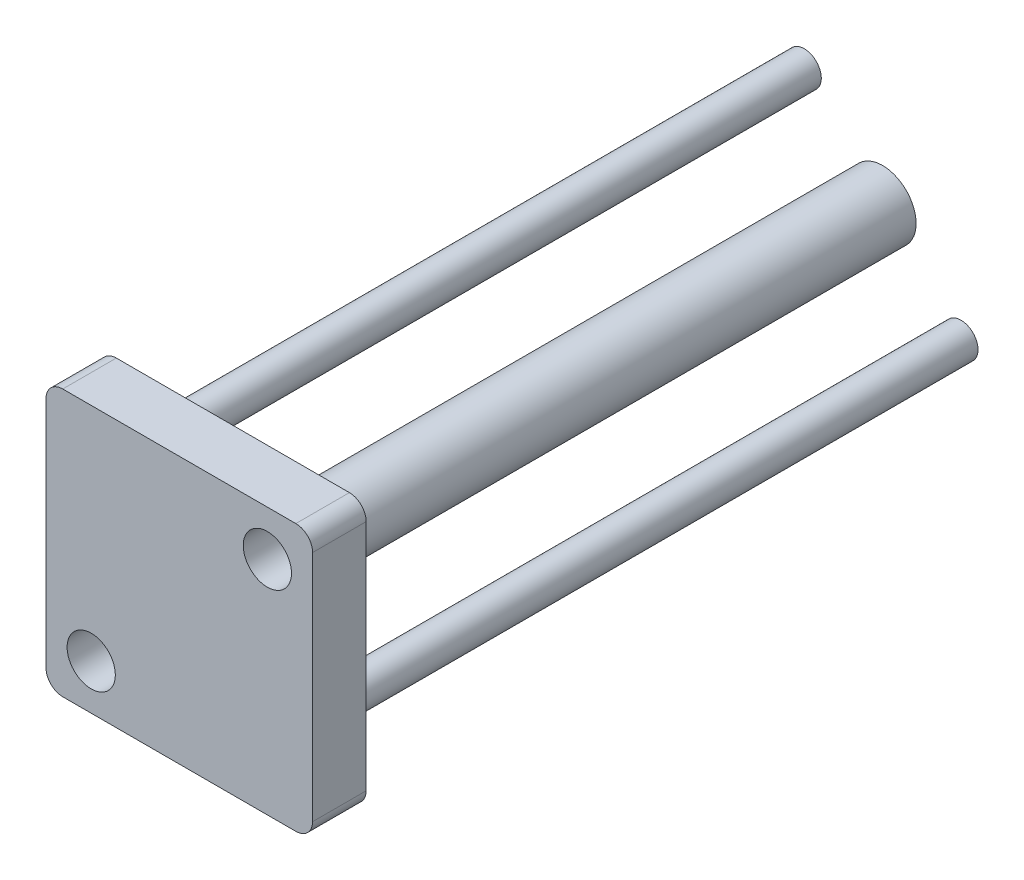
ISO-10303-21;
HEADER;
FILE_DESCRIPTION(('STEP AP214'),'2;1');
FILE_NAME('part.step','',(''),(''),'','','');
FILE_SCHEMA(('AUTOMOTIVE_DESIGN { 1 0 10303 214 1 1 1 1 }'));
ENDSEC;
DATA;
#1=APPLICATION_CONTEXT('core data for automotive mechanical design processes');
#2=APPLICATION_PROTOCOL_DEFINITION('international standard','automotive_design',2000,#1);
#3=PRODUCT_CONTEXT('',#1,'mechanical');
#4=PRODUCT('Part','Part','',(#3));
#5=PRODUCT_RELATED_PRODUCT_CATEGORY('part','',(#4));
#6=PRODUCT_DEFINITION_FORMATION('','',#4);
#7=PRODUCT_DEFINITION_CONTEXT('part definition',#1,'design');
#8=PRODUCT_DEFINITION('design','',#6,#7);
#9=PRODUCT_DEFINITION_SHAPE('','',#8);
#10=(LENGTH_UNIT() NAMED_UNIT(*) SI_UNIT(.MILLI.,.METRE.));
#11=(NAMED_UNIT(*) PLANE_ANGLE_UNIT() SI_UNIT($,.RADIAN.));
#12=(NAMED_UNIT(*) SI_UNIT($,.STERADIAN.) SOLID_ANGLE_UNIT());
#13=UNCERTAINTY_MEASURE_WITH_UNIT(LENGTH_MEASURE(1.E-05),#10,'distance_accuracy_value','');
#14=(GEOMETRIC_REPRESENTATION_CONTEXT(3) GLOBAL_UNCERTAINTY_ASSIGNED_CONTEXT((#13)) GLOBAL_UNIT_ASSIGNED_CONTEXT((#10,
#11,#12)) REPRESENTATION_CONTEXT('',''));
#15=CARTESIAN_POINT('',(0.,0.,0.));
#16=DIRECTION('',(0.,0.,1.));
#17=DIRECTION('',(1.,0.,0.));
#18=AXIS2_PLACEMENT_3D('',#15,#16,#17);
#19=CARTESIAN_POINT('',(0.,0.,97.));
#20=DIRECTION('',(0.,0.,-1.));
#21=DIRECTION('',(-1.,0.,0.));
#22=AXIS2_PLACEMENT_3D('',#19,#20,#21);
#23=CYLINDRICAL_SURFACE('',#22,5.);
#24=CARTESIAN_POINT('',(0.,0.,97.));
#25=DIRECTION('',(0.,0.,1.));
#26=DIRECTION('',(1.,0.,0.));
#27=AXIS2_PLACEMENT_3D('',#24,#25,#26);
#28=CIRCLE('',#27,5.);
#29=CARTESIAN_POINT('',(5.,0.,97.));
#30=VERTEX_POINT('',#29);
#31=EDGE_CURVE('E194',#30,#30,#28,.T.);
#32=ORIENTED_EDGE('',*,*,#31,.F.);
#33=EDGE_LOOP('',(#32));
#34=FACE_BOUND('',#33,.T.);
#35=CARTESIAN_POINT('',(0.,0.,0.));
#36=DIRECTION('',(0.,0.,1.));
#37=DIRECTION('',(1.,0.,0.));
#38=AXIS2_PLACEMENT_3D('',#35,#36,#37);
#39=CIRCLE('',#38,5.);
#40=CARTESIAN_POINT('',(5.,0.,0.));
#41=VERTEX_POINT('',#40);
#42=EDGE_CURVE('E193',#41,#41,#39,.T.);
#43=ORIENTED_EDGE('',*,*,#42,.T.);
#44=EDGE_LOOP('',(#43));
#45=FACE_BOUND('',#44,.T.);
#46=ADVANCED_FACE('F45',(#34,#45),#23,.T.);
#47=CARTESIAN_POINT('',(0.,0.,0.));
#48=DIRECTION('',(0.,0.,1.));
#49=DIRECTION('',(1.,0.,0.));
#50=AXIS2_PLACEMENT_3D('',#47,#48,#49);
#51=PLANE('',#50);
#52=ORIENTED_EDGE('',*,*,#42,.F.);
#53=EDGE_LOOP('',(#52));
#54=FACE_BOUND('',#53,.T.);
#55=ADVANCED_FACE('F283',(#54),#51,.F.);
#56=CARTESIAN_POINT('',(-17.4,-17.4,105.));
#57=DIRECTION('',(0.,0.,-1.));
#58=DIRECTION('',(-1.,0.,0.));
#59=AXIS2_PLACEMENT_3D('',#56,#57,#58);
#60=PLANE('',#59);
#61=CARTESIAN_POINT('',(-17.4,-17.4,105.));
#62=DIRECTION('',(0.,0.,1.));
#63=DIRECTION('',(-1.,0.,0.));
#64=AXIS2_PLACEMENT_3D('',#61,#62,#63);
#65=CIRCLE('',#64,2.5);
#66=CARTESIAN_POINT('',(-19.9,-17.4,105.));
#67=VERTEX_POINT('',#66);
#68=CARTESIAN_POINT('',(-17.4,-19.9,105.));
#69=VERTEX_POINT('',#68);
#70=EDGE_CURVE('E171',#67,#69,#65,.T.);
#71=ORIENTED_EDGE('',*,*,#70,.T.);
#72=DIRECTION('',(1.,0.,0.));
#73=VECTOR('',#72,1.);
#74=CARTESIAN_POINT('',(-17.4,-19.9,105.));
#75=LINE('',#74,#73);
#76=CARTESIAN_POINT('',(17.4,-19.9,105.));
#77=VERTEX_POINT('',#76);
#78=EDGE_CURVE('E106',#69,#77,#75,.T.);
#79=ORIENTED_EDGE('',*,*,#78,.T.);
#80=CARTESIAN_POINT('',(17.4,-17.4,105.));
#81=DIRECTION('',(0.,0.,1.));
#82=DIRECTION('',(1.,0.,0.));
#83=AXIS2_PLACEMENT_3D('',#80,#81,#82);
#84=CIRCLE('',#83,2.5);
#85=CARTESIAN_POINT('',(19.9,-17.4,105.));
#86=VERTEX_POINT('',#85);
#87=EDGE_CURVE('E247',#77,#86,#84,.T.);
#88=ORIENTED_EDGE('',*,*,#87,.T.);
#89=DIRECTION('',(0.,1.,0.));
#90=VECTOR('',#89,1.);
#91=CARTESIAN_POINT('',(19.9,-17.4,105.));
#92=LINE('',#91,#90);
#93=CARTESIAN_POINT('',(19.9,17.4,105.));
#94=VERTEX_POINT('',#93);
#95=EDGE_CURVE('E250',#86,#94,#92,.T.);
#96=ORIENTED_EDGE('',*,*,#95,.T.);
#97=CARTESIAN_POINT('',(17.4,17.4,105.));
#98=DIRECTION('',(0.,0.,1.));
#99=DIRECTION('',(-1.,0.,0.));
#100=AXIS2_PLACEMENT_3D('',#97,#98,#99);
#101=CIRCLE('',#100,2.50000000000001);
#102=CARTESIAN_POINT('',(17.4,19.9,105.));
#103=VERTEX_POINT('',#102);
#104=EDGE_CURVE('E126',#94,#103,#101,.T.);
#105=ORIENTED_EDGE('',*,*,#104,.T.);
#106=DIRECTION('',(-1.,0.,0.));
#107=VECTOR('',#106,1.);
#108=CARTESIAN_POINT('',(-17.4,19.9,105.));
#109=LINE('',#108,#107);
#110=CARTESIAN_POINT('',(-17.4,19.9,105.));
#111=VERTEX_POINT('',#110);
#112=EDGE_CURVE('E119',#103,#111,#109,.T.);
#113=ORIENTED_EDGE('',*,*,#112,.T.);
#114=CARTESIAN_POINT('',(-17.4,17.4,105.));
#115=DIRECTION('',(0.,0.,1.));
#116=DIRECTION('',(-1.,0.,0.));
#117=AXIS2_PLACEMENT_3D('',#114,#115,#116);
#118=CIRCLE('',#117,2.5);
#119=CARTESIAN_POINT('',(-19.9,17.4,105.));
#120=VERTEX_POINT('',#119);
#121=EDGE_CURVE('E124',#111,#120,#118,.T.);
#122=ORIENTED_EDGE('',*,*,#121,.T.);
#123=DIRECTION('',(0.,-1.,0.));
#124=VECTOR('',#123,1.);
#125=CARTESIAN_POINT('',(-19.9,-17.4,105.));
#126=LINE('',#125,#124);
#127=EDGE_CURVE('E62',#120,#67,#126,.T.);
#128=ORIENTED_EDGE('',*,*,#127,.T.);
#129=EDGE_LOOP('',(#71,#79,#88,#96,#105,#113,#122,#128));
#130=FACE_BOUND('',#129,.T.);
#131=CARTESIAN_POINT('',(13.15,13.15,105.));
#132=DIRECTION('',(0.,0.,1.));
#133=DIRECTION('',(1.,0.,0.));
#134=AXIS2_PLACEMENT_3D('',#131,#132,#133);
#135=CIRCLE('',#134,3.6);
#136=CARTESIAN_POINT('',(16.75,13.15,105.));
#137=VERTEX_POINT('',#136);
#138=EDGE_CURVE('E153',#137,#137,#135,.T.);
#139=ORIENTED_EDGE('',*,*,#138,.F.);
#140=EDGE_LOOP('',(#139));
#141=FACE_BOUND('',#140,.T.);
#142=CARTESIAN_POINT('',(-13.15,-13.15,105.));
#143=DIRECTION('',(0.,0.,1.));
#144=DIRECTION('',(1.,0.,0.));
#145=AXIS2_PLACEMENT_3D('',#142,#143,#144);
#146=CIRCLE('',#145,3.6);
#147=CARTESIAN_POINT('',(-9.55000000000001,-13.15,105.));
#148=VERTEX_POINT('',#147);
#149=EDGE_CURVE('E226',#148,#148,#146,.T.);
#150=ORIENTED_EDGE('',*,*,#149,.F.);
#151=EDGE_LOOP('',(#150));
#152=FACE_BOUND('',#151,.T.);
#153=ADVANCED_FACE('F121',(#130,#141,#152),#60,.F.);
#154=CARTESIAN_POINT('',(-17.4,-17.4,97.));
#155=DIRECTION('',(0.,0.,-1.));
#156=DIRECTION('',(-1.,0.,0.));
#157=AXIS2_PLACEMENT_3D('',#154,#155,#156);
#158=PLANE('',#157);
#159=CARTESIAN_POINT('',(11.7,-11.7,97.));
#160=DIRECTION('',(0.,0.,-1.));
#161=DIRECTION('',(-1.,0.,0.));
#162=AXIS2_PLACEMENT_3D('',#159,#160,#161);
#163=CIRCLE('',#162,2.55);
#164=CARTESIAN_POINT('',(9.15,-11.7,97.));
#165=VERTEX_POINT('',#164);
#166=EDGE_CURVE('E11',#165,#165,#163,.T.);
#167=ORIENTED_EDGE('',*,*,#166,.F.);
#168=EDGE_LOOP('',(#167));
#169=FACE_BOUND('',#168,.T.);
#170=CARTESIAN_POINT('',(-11.7,11.7,97.));
#171=DIRECTION('',(0.,0.,-1.));
#172=DIRECTION('',(-1.,0.,0.));
#173=AXIS2_PLACEMENT_3D('',#170,#171,#172);
#174=CIRCLE('',#173,2.55);
#175=CARTESIAN_POINT('',(-14.25,11.7,97.));
#176=VERTEX_POINT('',#175);
#177=EDGE_CURVE('E54',#176,#176,#174,.T.);
#178=ORIENTED_EDGE('',*,*,#177,.F.);
#179=EDGE_LOOP('',(#178));
#180=FACE_BOUND('',#179,.T.);
#181=ORIENTED_EDGE('',*,*,#31,.T.);
#182=EDGE_LOOP('',(#181));
#183=FACE_BOUND('',#182,.T.);
#184=CARTESIAN_POINT('',(13.15,13.15,97.));
#185=DIRECTION('',(0.,0.,1.));
#186=DIRECTION('',(1.,0.,0.));
#187=AXIS2_PLACEMENT_3D('',#184,#185,#186);
#188=CIRCLE('',#187,3.6);
#189=CARTESIAN_POINT('',(16.75,13.15,97.));
#190=VERTEX_POINT('',#189);
#191=EDGE_CURVE('E218',#190,#190,#188,.T.);
#192=ORIENTED_EDGE('',*,*,#191,.T.);
#193=EDGE_LOOP('',(#192));
#194=FACE_BOUND('',#193,.T.);
#195=CARTESIAN_POINT('',(-17.4,-17.4,97.));
#196=DIRECTION('',(0.,0.,1.));
#197=DIRECTION('',(-1.,0.,0.));
#198=AXIS2_PLACEMENT_3D('',#195,#196,#197);
#199=CIRCLE('',#198,2.5);
#200=CARTESIAN_POINT('',(-19.9,-17.4,97.));
#201=VERTEX_POINT('',#200);
#202=CARTESIAN_POINT('',(-17.4,-19.9,97.));
#203=VERTEX_POINT('',#202);
#204=EDGE_CURVE('E148',#201,#203,#199,.T.);
#205=ORIENTED_EDGE('',*,*,#204,.F.);
#206=DIRECTION('',(0.,-1.,0.));
#207=VECTOR('',#206,1.);
#208=CARTESIAN_POINT('',(-19.9,-17.4,97.));
#209=LINE('',#208,#207);
#210=CARTESIAN_POINT('',(-19.9,17.4,97.));
#211=VERTEX_POINT('',#210);
#212=EDGE_CURVE('E97',#211,#201,#209,.T.);
#213=ORIENTED_EDGE('',*,*,#212,.F.);
#214=CARTESIAN_POINT('',(-17.4,17.4,97.));
#215=DIRECTION('',(0.,0.,1.));
#216=DIRECTION('',(-1.,0.,0.));
#217=AXIS2_PLACEMENT_3D('',#214,#215,#216);
#218=CIRCLE('',#217,2.5);
#219=CARTESIAN_POINT('',(-17.4,19.9,97.));
#220=VERTEX_POINT('',#219);
#221=EDGE_CURVE('E91',#220,#211,#218,.T.);
#222=ORIENTED_EDGE('',*,*,#221,.F.);
#223=DIRECTION('',(-1.,0.,0.));
#224=VECTOR('',#223,1.);
#225=CARTESIAN_POINT('',(-17.4,19.9,97.));
#226=LINE('',#225,#224);
#227=CARTESIAN_POINT('',(17.4,19.9,97.));
#228=VERTEX_POINT('',#227);
#229=EDGE_CURVE('E135',#228,#220,#226,.T.);
#230=ORIENTED_EDGE('',*,*,#229,.F.);
#231=CARTESIAN_POINT('',(17.4,17.4,97.));
#232=DIRECTION('',(0.,0.,1.));
#233=DIRECTION('',(-1.,0.,0.));
#234=AXIS2_PLACEMENT_3D('',#231,#232,#233);
#235=CIRCLE('',#234,2.50000000000001);
#236=CARTESIAN_POINT('',(19.9,17.4,97.));
#237=VERTEX_POINT('',#236);
#238=EDGE_CURVE('E162',#237,#228,#235,.T.);
#239=ORIENTED_EDGE('',*,*,#238,.F.);
#240=DIRECTION('',(0.,1.,0.));
#241=VECTOR('',#240,1.);
#242=CARTESIAN_POINT('',(19.9,-17.4,97.));
#243=LINE('',#242,#241);
#244=CARTESIAN_POINT('',(19.9,-17.4,97.));
#245=VERTEX_POINT('',#244);
#246=EDGE_CURVE('E159',#245,#237,#243,.T.);
#247=ORIENTED_EDGE('',*,*,#246,.F.);
#248=CARTESIAN_POINT('',(17.4,-17.4,97.));
#249=DIRECTION('',(0.,0.,1.));
#250=DIRECTION('',(1.,0.,0.));
#251=AXIS2_PLACEMENT_3D('',#248,#249,#250);
#252=CIRCLE('',#251,2.5);
#253=CARTESIAN_POINT('',(17.4,-19.9,97.));
#254=VERTEX_POINT('',#253);
#255=EDGE_CURVE('E156',#254,#245,#252,.T.);
#256=ORIENTED_EDGE('',*,*,#255,.F.);
#257=DIRECTION('',(1.,0.,0.));
#258=VECTOR('',#257,1.);
#259=CARTESIAN_POINT('',(-17.4,-19.9,97.));
#260=LINE('',#259,#258);
#261=EDGE_CURVE('E152',#203,#254,#260,.T.);
#262=ORIENTED_EDGE('',*,*,#261,.F.);
#263=EDGE_LOOP('',(#205,#213,#222,#230,#239,#247,#256,#262));
#264=FACE_BOUND('',#263,.T.);
#265=CARTESIAN_POINT('',(-13.15,-13.15,97.));
#266=DIRECTION('',(0.,0.,1.));
#267=DIRECTION('',(1.,0.,0.));
#268=AXIS2_PLACEMENT_3D('',#265,#266,#267);
#269=CIRCLE('',#268,3.6);
#270=CARTESIAN_POINT('',(-9.55000000000001,-13.15,97.));
#271=VERTEX_POINT('',#270);
#272=EDGE_CURVE('E223',#271,#271,#269,.T.);
#273=ORIENTED_EDGE('',*,*,#272,.T.);
#274=EDGE_LOOP('',(#273));
#275=FACE_BOUND('',#274,.T.);
#276=ADVANCED_FACE('F207',(#169,#180,#183,#194,#264,#275),#158,.T.);
#277=CARTESIAN_POINT('',(-17.4,-17.4,105.));
#278=DIRECTION('',(0.,0.,-1.));
#279=DIRECTION('',(-1.,0.,0.));
#280=AXIS2_PLACEMENT_3D('',#277,#278,#279);
#281=CYLINDRICAL_SURFACE('',#280,2.5);
#282=ORIENTED_EDGE('',*,*,#204,.T.);
#283=DIRECTION('',(0.,0.,-1.));
#284=VECTOR('',#283,1.);
#285=CARTESIAN_POINT('',(-17.4,-19.9,105.));
#286=LINE('',#285,#284);
#287=EDGE_CURVE('E190',#69,#203,#286,.T.);
#288=ORIENTED_EDGE('',*,*,#287,.F.);
#289=ORIENTED_EDGE('',*,*,#70,.F.);
#290=DIRECTION('',(0.,0.,-1.));
#291=VECTOR('',#290,1.);
#292=CARTESIAN_POINT('',(-19.9,-17.4,105.));
#293=LINE('',#292,#291);
#294=EDGE_CURVE('E144',#67,#201,#293,.T.);
#295=ORIENTED_EDGE('',*,*,#294,.T.);
#296=EDGE_LOOP('',(#282,#288,#289,#295));
#297=FACE_BOUND('',#296,.T.);
#298=ADVANCED_FACE('F210',(#297),#281,.T.);
#299=CARTESIAN_POINT('',(-17.4,-19.9,105.));
#300=DIRECTION('',(0.,1.,0.));
#301=DIRECTION('',(0.,0.,1.));
#302=AXIS2_PLACEMENT_3D('',#299,#300,#301);
#303=PLANE('',#302);
#304=ORIENTED_EDGE('',*,*,#261,.T.);
#305=DIRECTION('',(0.,0.,-1.));
#306=VECTOR('',#305,1.);
#307=CARTESIAN_POINT('',(17.4,-19.9,105.));
#308=LINE('',#307,#306);
#309=EDGE_CURVE('E186',#77,#254,#308,.T.);
#310=ORIENTED_EDGE('',*,*,#309,.F.);
#311=ORIENTED_EDGE('',*,*,#78,.F.);
#312=ORIENTED_EDGE('',*,*,#287,.T.);
#313=EDGE_LOOP('',(#304,#310,#311,#312));
#314=FACE_BOUND('',#313,.T.);
#315=ADVANCED_FACE('F266',(#314),#303,.F.);
#316=CARTESIAN_POINT('',(17.4,-17.4,105.));
#317=DIRECTION('',(0.,0.,-1.));
#318=DIRECTION('',(-1.,0.,0.));
#319=AXIS2_PLACEMENT_3D('',#316,#317,#318);
#320=CYLINDRICAL_SURFACE('',#319,2.5);
#321=ORIENTED_EDGE('',*,*,#255,.T.);
#322=DIRECTION('',(0.,0.,-1.));
#323=VECTOR('',#322,1.);
#324=CARTESIAN_POINT('',(19.9,-17.4,105.));
#325=LINE('',#324,#323);
#326=EDGE_CURVE('E182',#86,#245,#325,.T.);
#327=ORIENTED_EDGE('',*,*,#326,.F.);
#328=ORIENTED_EDGE('',*,*,#87,.F.);
#329=ORIENTED_EDGE('',*,*,#309,.T.);
#330=EDGE_LOOP('',(#321,#327,#328,#329));
#331=FACE_BOUND('',#330,.T.);
#332=ADVANCED_FACE('F265',(#331),#320,.T.);
#333=CARTESIAN_POINT('',(19.9,-17.4,105.));
#334=DIRECTION('',(-1.,0.,0.));
#335=DIRECTION('',(0.,-1.,0.));
#336=AXIS2_PLACEMENT_3D('',#333,#334,#335);
#337=PLANE('',#336);
#338=ORIENTED_EDGE('',*,*,#246,.T.);
#339=DIRECTION('',(0.,0.,-1.));
#340=VECTOR('',#339,1.);
#341=CARTESIAN_POINT('',(19.9,17.4,105.));
#342=LINE('',#341,#340);
#343=EDGE_CURVE('E178',#94,#237,#342,.T.);
#344=ORIENTED_EDGE('',*,*,#343,.F.);
#345=ORIENTED_EDGE('',*,*,#95,.F.);
#346=ORIENTED_EDGE('',*,*,#326,.T.);
#347=EDGE_LOOP('',(#338,#344,#345,#346));
#348=FACE_BOUND('',#347,.T.);
#349=ADVANCED_FACE('F258',(#348),#337,.F.);
#350=CARTESIAN_POINT('',(17.4,17.4,105.));
#351=DIRECTION('',(0.,0.,-1.));
#352=DIRECTION('',(-1.,0.,0.));
#353=AXIS2_PLACEMENT_3D('',#350,#351,#352);
#354=CYLINDRICAL_SURFACE('',#353,2.50000000000001);
#355=ORIENTED_EDGE('',*,*,#238,.T.);
#356=DIRECTION('',(0.,0.,-1.));
#357=VECTOR('',#356,1.);
#358=CARTESIAN_POINT('',(17.4,19.9,105.));
#359=LINE('',#358,#357);
#360=EDGE_CURVE('E137',#103,#228,#359,.T.);
#361=ORIENTED_EDGE('',*,*,#360,.F.);
#362=ORIENTED_EDGE('',*,*,#104,.F.);
#363=ORIENTED_EDGE('',*,*,#343,.T.);
#364=EDGE_LOOP('',(#355,#361,#362,#363));
#365=FACE_BOUND('',#364,.T.);
#366=ADVANCED_FACE('F262',(#365),#354,.T.);
#367=CARTESIAN_POINT('',(-17.4,19.9,105.));
#368=DIRECTION('',(0.,-1.,0.));
#369=DIRECTION('',(0.,0.,-1.));
#370=AXIS2_PLACEMENT_3D('',#367,#368,#369);
#371=PLANE('',#370);
#372=ORIENTED_EDGE('',*,*,#229,.T.);
#373=DIRECTION('',(0.,0.,-1.));
#374=VECTOR('',#373,1.);
#375=CARTESIAN_POINT('',(-17.4,19.9,105.));
#376=LINE('',#375,#374);
#377=EDGE_CURVE('E132',#111,#220,#376,.T.);
#378=ORIENTED_EDGE('',*,*,#377,.F.);
#379=ORIENTED_EDGE('',*,*,#112,.F.);
#380=ORIENTED_EDGE('',*,*,#360,.T.);
#381=EDGE_LOOP('',(#372,#378,#379,#380));
#382=FACE_BOUND('',#381,.T.);
#383=ADVANCED_FACE('F133',(#382),#371,.F.);
#384=CARTESIAN_POINT('',(-17.4,17.4,105.));
#385=DIRECTION('',(0.,0.,-1.));
#386=DIRECTION('',(-1.,0.,0.));
#387=AXIS2_PLACEMENT_3D('',#384,#385,#386);
#388=CYLINDRICAL_SURFACE('',#387,2.5);
#389=ORIENTED_EDGE('',*,*,#221,.T.);
#390=DIRECTION('',(0.,0.,-1.));
#391=VECTOR('',#390,1.);
#392=CARTESIAN_POINT('',(-19.9,17.4,105.));
#393=LINE('',#392,#391);
#394=EDGE_CURVE('E138',#120,#211,#393,.T.);
#395=ORIENTED_EDGE('',*,*,#394,.F.);
#396=ORIENTED_EDGE('',*,*,#121,.F.);
#397=ORIENTED_EDGE('',*,*,#377,.T.);
#398=EDGE_LOOP('',(#389,#395,#396,#397));
#399=FACE_BOUND('',#398,.T.);
#400=ADVANCED_FACE('F140',(#399),#388,.T.);
#401=CARTESIAN_POINT('',(-19.9,-17.4,105.));
#402=DIRECTION('',(1.,0.,0.));
#403=DIRECTION('',(0.,1.,0.));
#404=AXIS2_PLACEMENT_3D('',#401,#402,#403);
#405=PLANE('',#404);
#406=ORIENTED_EDGE('',*,*,#212,.T.);
#407=ORIENTED_EDGE('',*,*,#294,.F.);
#408=ORIENTED_EDGE('',*,*,#127,.F.);
#409=ORIENTED_EDGE('',*,*,#394,.T.);
#410=EDGE_LOOP('',(#406,#407,#408,#409));
#411=FACE_BOUND('',#410,.T.);
#412=ADVANCED_FACE('F270',(#411),#405,.F.);
#413=CARTESIAN_POINT('',(13.15,13.15,105.));
#414=DIRECTION('',(0.,0.,-1.));
#415=DIRECTION('',(-1.,0.,0.));
#416=AXIS2_PLACEMENT_3D('',#413,#414,#415);
#417=CYLINDRICAL_SURFACE('',#416,3.6);
#418=ORIENTED_EDGE('',*,*,#138,.T.);
#419=EDGE_LOOP('',(#418));
#420=FACE_BOUND('',#419,.T.);
#421=ORIENTED_EDGE('',*,*,#191,.F.);
#422=EDGE_LOOP('',(#421));
#423=FACE_BOUND('',#422,.T.);
#424=ADVANCED_FACE('F272',(#420,#423),#417,.F.);
#425=CARTESIAN_POINT('',(-13.15,-13.15,105.));
#426=DIRECTION('',(0.,0.,-1.));
#427=DIRECTION('',(-1.,0.,0.));
#428=AXIS2_PLACEMENT_3D('',#425,#426,#427);
#429=CYLINDRICAL_SURFACE('',#428,3.6);
#430=ORIENTED_EDGE('',*,*,#149,.T.);
#431=EDGE_LOOP('',(#430));
#432=FACE_BOUND('',#431,.T.);
#433=ORIENTED_EDGE('',*,*,#272,.F.);
#434=EDGE_LOOP('',(#433));
#435=FACE_BOUND('',#434,.T.);
#436=ADVANCED_FACE('F278',(#432,#435),#429,.F.);
#437=CARTESIAN_POINT('',(-11.7,11.7,0.));
#438=DIRECTION('',(0.,0.,-1.));
#439=DIRECTION('',(-1.,0.,0.));
#440=AXIS2_PLACEMENT_3D('',#437,#438,#439);
#441=PLANE('',#440);
#442=CARTESIAN_POINT('',(-11.7,11.7,0.));
#443=DIRECTION('',(0.,0.,-1.));
#444=DIRECTION('',(-1.,0.,0.));
#445=AXIS2_PLACEMENT_3D('',#442,#443,#444);
#446=CIRCLE('',#445,2.55);
#447=CARTESIAN_POINT('',(-14.25,11.7,0.));
#448=VERTEX_POINT('',#447);
#449=EDGE_CURVE('E234',#448,#448,#446,.T.);
#450=ORIENTED_EDGE('',*,*,#449,.T.);
#451=EDGE_LOOP('',(#450));
#452=FACE_BOUND('',#451,.T.);
#453=ADVANCED_FACE('F336',(#452),#441,.T.);
#454=CARTESIAN_POINT('',(-11.7,11.7,105.002));
#455=DIRECTION('',(0.,0.,-1.));
#456=DIRECTION('',(-1.,0.,0.));
#457=AXIS2_PLACEMENT_3D('',#454,#455,#456);
#458=CYLINDRICAL_SURFACE('',#457,2.55);
#459=ORIENTED_EDGE('',*,*,#177,.T.);
#460=EDGE_LOOP('',(#459));
#461=FACE_BOUND('',#460,.T.);
#462=ORIENTED_EDGE('',*,*,#449,.F.);
#463=EDGE_LOOP('',(#462));
#464=FACE_BOUND('',#463,.T.);
#465=ADVANCED_FACE('F204',(#461,#464),#458,.T.);
#466=CARTESIAN_POINT('',(11.7,-11.7,0.));
#467=DIRECTION('',(0.,0.,-1.));
#468=DIRECTION('',(-1.,0.,0.));
#469=AXIS2_PLACEMENT_3D('',#466,#467,#468);
#470=PLANE('',#469);
#471=CARTESIAN_POINT('',(11.7,-11.7,0.));
#472=DIRECTION('',(0.,0.,-1.));
#473=DIRECTION('',(-1.,0.,0.));
#474=AXIS2_PLACEMENT_3D('',#471,#472,#473);
#475=CIRCLE('',#474,2.55);
#476=CARTESIAN_POINT('',(9.15,-11.7,0.));
#477=VERTEX_POINT('',#476);
#478=EDGE_CURVE('E227',#477,#477,#475,.T.);
#479=ORIENTED_EDGE('',*,*,#478,.T.);
#480=EDGE_LOOP('',(#479));
#481=FACE_BOUND('',#480,.T.);
#482=ADVANCED_FACE('F356',(#481),#470,.T.);
#483=CARTESIAN_POINT('',(11.7,-11.7,105.002));
#484=DIRECTION('',(0.,0.,-1.));
#485=DIRECTION('',(-1.,0.,0.));
#486=AXIS2_PLACEMENT_3D('',#483,#484,#485);
#487=CYLINDRICAL_SURFACE('',#486,2.55);
#488=ORIENTED_EDGE('',*,*,#166,.T.);
#489=EDGE_LOOP('',(#488));
#490=FACE_BOUND('',#489,.T.);
#491=ORIENTED_EDGE('',*,*,#478,.F.);
#492=EDGE_LOOP('',(#491));
#493=FACE_BOUND('',#492,.T.);
#494=ADVANCED_FACE('F348',(#490,#493),#487,.T.);
#495=CLOSED_SHELL('',(#46,#55,#153,#276,#298,#315,#332,#349,#366,#383,#400,#412,#424,#436,#453,
#465,#482,#494));
#496=MANIFOLD_SOLID_BREP('B2',#495);
#497=ADVANCED_BREP_SHAPE_REPRESENTATION('',(#18,#496),#14);
#498=SHAPE_DEFINITION_REPRESENTATION(#9,#497);
ENDSEC;
END-ISO-10303-21;
